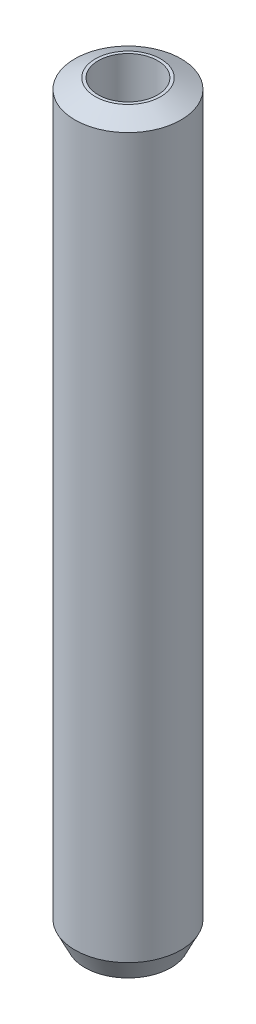
ISO-10303-21;
HEADER;
FILE_DESCRIPTION(('STEP AP214'),'2;1');
FILE_NAME('part.step','',(''),(''),'','','');
FILE_SCHEMA(('AUTOMOTIVE_DESIGN { 1 0 10303 214 1 1 1 1 }'));
ENDSEC;
DATA;
#1=APPLICATION_CONTEXT('core data for automotive mechanical design processes');
#2=APPLICATION_PROTOCOL_DEFINITION('international standard','automotive_design',2000,#1);
#3=PRODUCT_CONTEXT('',#1,'mechanical');
#4=PRODUCT('Part','Part','',(#3));
#5=PRODUCT_RELATED_PRODUCT_CATEGORY('part','',(#4));
#6=PRODUCT_DEFINITION_FORMATION('','',#4);
#7=PRODUCT_DEFINITION_CONTEXT('part definition',#1,'design');
#8=PRODUCT_DEFINITION('design','',#6,#7);
#9=PRODUCT_DEFINITION_SHAPE('','',#8);
#10=(LENGTH_UNIT() NAMED_UNIT(*) SI_UNIT(.MILLI.,.METRE.));
#11=(NAMED_UNIT(*) PLANE_ANGLE_UNIT() SI_UNIT($,.RADIAN.));
#12=(NAMED_UNIT(*) SI_UNIT($,.STERADIAN.) SOLID_ANGLE_UNIT());
#13=UNCERTAINTY_MEASURE_WITH_UNIT(LENGTH_MEASURE(1.E-05),#10,'distance_accuracy_value','');
#14=(GEOMETRIC_REPRESENTATION_CONTEXT(3) GLOBAL_UNCERTAINTY_ASSIGNED_CONTEXT((#13)) GLOBAL_UNIT_ASSIGNED_CONTEXT((#10,
#11,#12)) REPRESENTATION_CONTEXT('',''));
#15=CARTESIAN_POINT('',(0.,0.,0.));
#16=DIRECTION('',(0.,0.,1.));
#17=DIRECTION('',(1.,0.,0.));
#18=AXIS2_PLACEMENT_3D('',#15,#16,#17);
#19=CARTESIAN_POINT('',(0.,211.831143882468,0.));
#20=DIRECTION('',(0.,-1.,0.));
#21=DIRECTION('',(0.,0.,-1.));
#22=AXIS2_PLACEMENT_3D('',#19,#20,#21);
#23=CYLINDRICAL_SURFACE('',#22,15.);
#24=CARTESIAN_POINT('',(0.,209.004150964859,0.));
#25=DIRECTION('',(0.,1.,0.));
#26=DIRECTION('',(0.,0.,1.));
#27=AXIS2_PLACEMENT_3D('',#24,#25,#26);
#28=CIRCLE('',#27,15.);
#29=CARTESIAN_POINT('',(0.,209.004150964859,15.));
#30=VERTEX_POINT('',#29);
#31=EDGE_CURVE('E50',#30,#30,#28,.F.);
#32=ORIENTED_EDGE('',*,*,#31,.T.);
#33=EDGE_LOOP('',(#32));
#34=FACE_BOUND('',#33,.T.);
#35=CARTESIAN_POINT('',(0.,5.75034645378297,0.));
#36=DIRECTION('',(0.,1.,0.));
#37=DIRECTION('',(0.,0.,1.));
#38=AXIS2_PLACEMENT_3D('',#35,#36,#37);
#39=CIRCLE('',#38,15.);
#40=CARTESIAN_POINT('',(0.,5.75034645378297,15.));
#41=VERTEX_POINT('',#40);
#42=EDGE_CURVE('E51',#41,#41,#39,.T.);
#43=ORIENTED_EDGE('',*,*,#42,.T.);
#44=EDGE_LOOP('',(#43));
#45=FACE_BOUND('',#44,.T.);
#46=ADVANCED_FACE('F39',(#34,#45),#23,.T.);
#47=CARTESIAN_POINT('',(0.,211.831143882468,0.));
#48=DIRECTION('',(0.,1.,0.));
#49=DIRECTION('',(0.,0.,1.));
#50=AXIS2_PLACEMENT_3D('',#47,#48,#49);
#51=PLANE('',#50);
#52=CARTESIAN_POINT('',(0.,211.831143882468,0.));
#53=DIRECTION('',(0.,1.,0.));
#54=DIRECTION('',(0.,0.,1.));
#55=AXIS2_PLACEMENT_3D('',#52,#53,#54);
#56=CIRCLE('',#55,9.24965354621687);
#57=CARTESIAN_POINT('',(0.,211.831143882468,9.24965354621687));
#58=VERTEX_POINT('',#57);
#59=EDGE_CURVE('E54',#58,#58,#56,.T.);
#60=ORIENTED_EDGE('',*,*,#59,.T.);
#61=EDGE_LOOP('',(#60));
#62=FACE_BOUND('',#61,.T.);
#63=CARTESIAN_POINT('',(0.,211.831143882468,0.));
#64=DIRECTION('',(0.,1.,0.));
#65=DIRECTION('',(0.,0.,1.));
#66=AXIS2_PLACEMENT_3D('',#63,#64,#65);
#67=CIRCLE('',#66,8.39289165627034);
#68=CARTESIAN_POINT('',(0.,211.831143882468,8.39289165627034));
#69=VERTEX_POINT('',#68);
#70=EDGE_CURVE('E58',#69,#69,#67,.T.);
#71=ORIENTED_EDGE('',*,*,#70,.F.);
#72=EDGE_LOOP('',(#71));
#73=FACE_BOUND('',#72,.T.);
#74=ADVANCED_FACE('F69',(#62,#73),#51,.T.);
#75=CARTESIAN_POINT('',(0.,0.,0.));
#76=DIRECTION('',(0.,1.,0.));
#77=DIRECTION('',(0.,0.,1.));
#78=AXIS2_PLACEMENT_3D('',#75,#76,#77);
#79=PLANE('',#78);
#80=CARTESIAN_POINT('',(0.,0.,0.));
#81=DIRECTION('',(0.,1.,0.));
#82=DIRECTION('',(0.,0.,1.));
#83=AXIS2_PLACEMENT_3D('',#80,#81,#82);
#84=CIRCLE('',#83,12.1730070823912);
#85=CARTESIAN_POINT('',(0.,0.,12.1730070823912));
#86=VERTEX_POINT('',#85);
#87=EDGE_CURVE('E10',#86,#86,#84,.F.);
#88=ORIENTED_EDGE('',*,*,#87,.T.);
#89=EDGE_LOOP('',(#88));
#90=FACE_BOUND('',#89,.T.);
#91=CARTESIAN_POINT('',(0.,0.,0.));
#92=DIRECTION('',(0.,1.,0.));
#93=DIRECTION('',(0.,0.,1.));
#94=AXIS2_PLACEMENT_3D('',#91,#92,#93);
#95=CIRCLE('',#94,8.39289165627034);
#96=CARTESIAN_POINT('',(0.,0.,8.39289165627034));
#97=VERTEX_POINT('',#96);
#98=EDGE_CURVE('E63',#97,#97,#95,.T.);
#99=ORIENTED_EDGE('',*,*,#98,.T.);
#100=EDGE_LOOP('',(#99));
#101=FACE_BOUND('',#100,.T.);
#102=ADVANCED_FACE('F75',(#90,#101),#79,.F.);
#103=CARTESIAN_POINT('',(0.,211.831143882468,0.));
#104=DIRECTION('',(0.,-1.,0.));
#105=DIRECTION('',(0.,0.,-1.));
#106=AXIS2_PLACEMENT_3D('',#103,#104,#105);
#107=CYLINDRICAL_SURFACE('',#106,8.39289165627034);
#108=ORIENTED_EDGE('',*,*,#70,.T.);
#109=EDGE_LOOP('',(#108));
#110=FACE_BOUND('',#109,.T.);
#111=ORIENTED_EDGE('',*,*,#98,.F.);
#112=EDGE_LOOP('',(#111));
#113=FACE_BOUND('',#112,.T.);
#114=ADVANCED_FACE('F70',(#110,#113),#107,.F.);
#115=CARTESIAN_POINT('',(0.,211.831143882468,0.));
#116=DIRECTION('',(0.,-1.,0.));
#117=DIRECTION('',(0.,0.,-1.));
#118=AXIS2_PLACEMENT_3D('',#115,#116,#117);
#119=CONICAL_SURFACE('',#118,9.24965354621687,1.11387410017022);
#120=ORIENTED_EDGE('',*,*,#31,.F.);
#121=EDGE_LOOP('',(#120));
#122=FACE_BOUND('',#121,.T.);
#123=ORIENTED_EDGE('',*,*,#59,.F.);
#124=EDGE_LOOP('',(#123));
#125=FACE_BOUND('',#124,.T.);
#126=ADVANCED_FACE('F81',(#122,#125),#119,.T.);
#127=CARTESIAN_POINT('',(0.,5.75034645378297,0.));
#128=DIRECTION('',(0.,1.,0.));
#129=DIRECTION('',(0.,0.,1.));
#130=AXIS2_PLACEMENT_3D('',#127,#128,#129);
#131=CONICAL_SURFACE('',#130,15.,0.456922226624677);
#132=ORIENTED_EDGE('',*,*,#87,.F.);
#133=EDGE_LOOP('',(#132));
#134=FACE_BOUND('',#133,.T.);
#135=ORIENTED_EDGE('',*,*,#42,.F.);
#136=EDGE_LOOP('',(#135));
#137=FACE_BOUND('',#136,.T.);
#138=ADVANCED_FACE('F45',(#134,#137),#131,.T.);
#139=CLOSED_SHELL('',(#46,#74,#102,#114,#126,#138));
#140=MANIFOLD_SOLID_BREP('B2',#139);
#141=ADVANCED_BREP_SHAPE_REPRESENTATION('',(#18,#140),#14);
#142=SHAPE_DEFINITION_REPRESENTATION(#9,#141);
ENDSEC;
END-ISO-10303-21;
